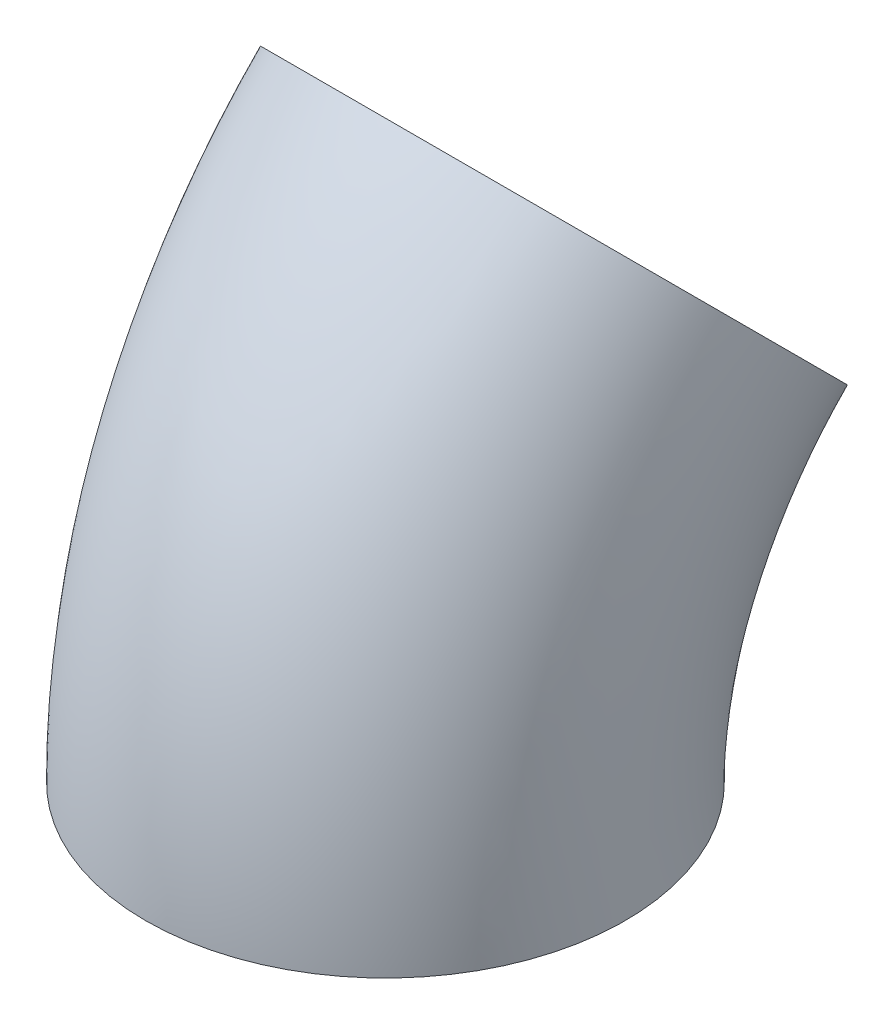
ISO-10303-21;
HEADER;
FILE_DESCRIPTION(('STEP AP214'),'2;1');
FILE_NAME('part.step','',(''),(''),'','','');
FILE_SCHEMA(('AUTOMOTIVE_DESIGN { 1 0 10303 214 1 1 1 1 }'));
ENDSEC;
DATA;
#1=APPLICATION_CONTEXT('core data for automotive mechanical design processes');
#2=APPLICATION_PROTOCOL_DEFINITION('international standard','automotive_design',2000,#1);
#3=PRODUCT_CONTEXT('',#1,'mechanical');
#4=PRODUCT('Part','Part','',(#3));
#5=PRODUCT_RELATED_PRODUCT_CATEGORY('part','',(#4));
#6=PRODUCT_DEFINITION_FORMATION('','',#4);
#7=PRODUCT_DEFINITION_CONTEXT('part definition',#1,'design');
#8=PRODUCT_DEFINITION('design','',#6,#7);
#9=PRODUCT_DEFINITION_SHAPE('','',#8);
#10=(LENGTH_UNIT() NAMED_UNIT(*) SI_UNIT(.MILLI.,.METRE.));
#11=(NAMED_UNIT(*) PLANE_ANGLE_UNIT() SI_UNIT($,.RADIAN.));
#12=(NAMED_UNIT(*) SI_UNIT($,.STERADIAN.) SOLID_ANGLE_UNIT());
#13=UNCERTAINTY_MEASURE_WITH_UNIT(LENGTH_MEASURE(1.E-05),#10,'distance_accuracy_value','');
#14=(GEOMETRIC_REPRESENTATION_CONTEXT(3) GLOBAL_UNCERTAINTY_ASSIGNED_CONTEXT((#13)) GLOBAL_UNIT_ASSIGNED_CONTEXT((#10,
#11,#12)) REPRESENTATION_CONTEXT('',''));
#15=CARTESIAN_POINT('',(0.,0.,0.));
#16=DIRECTION('',(0.,0.,1.));
#17=DIRECTION('',(1.,0.,0.));
#18=AXIS2_PLACEMENT_3D('',#15,#16,#17);
#19=CARTESIAN_POINT('',(0.,0.,-60.));
#20=DIRECTION('',(1.,0.,0.));
#21=DIRECTION('',(0.,0.,-1.));
#22=AXIS2_PLACEMENT_3D('',#19,#20,#21);
#23=TOROIDAL_SURFACE('',#22,60.,25.);
#24=CARTESIAN_POINT('',(0.,42.4264068711929,-17.5735931288072));
#25=DIRECTION('',(0.,0.707106781186547,-0.707106781186548));
#26=DIRECTION('',(0.,0.707106781186548,0.707106781186547));
#27=AXIS2_PLACEMENT_3D('',#24,#25,#26);
#28=CIRCLE('',#27,25.);
#29=CARTESIAN_POINT('',(0.,60.1040764008566,0.104076400856468));
#30=VERTEX_POINT('',#29);
#31=EDGE_CURVE('E36',#30,#30,#28,.T.);
#32=CARTESIAN_POINT('',(0.,0.,0.));
#33=DIRECTION('',(0.,1.,0.));
#34=DIRECTION('',(0.,0.,1.));
#35=AXIS2_PLACEMENT_3D('',#32,#33,#34);
#36=CIRCLE('',#35,25.);
#37=CARTESIAN_POINT('',(0.,0.,25.));
#38=VERTEX_POINT('',#37);
#39=EDGE_CURVE('E45',#38,#38,#36,.T.);
#40=CARTESIAN_POINT('',(0.,0.,-60.));
#41=DIRECTION('',(1.,0.,0.));
#42=DIRECTION('',(0.,0.,-1.));
#43=AXIS2_PLACEMENT_3D('',#40,#41,#42);
#44=CIRCLE('',#43,85.);
#45=EDGE_CURVE('',#30,#38,#44,.T.);
#46=ORIENTED_EDGE('',*,*,#31,.F.);
#47=ORIENTED_EDGE('',*,*,#39,.T.);
#48=ORIENTED_EDGE('',*,*,#45,.T.);
#49=ORIENTED_EDGE('',*,*,#45,.F.);
#50=EDGE_LOOP('',(#46,#48,#47,#49));
#51=FACE_BOUND('',#50,.T.);
#52=ADVANCED_FACE('F33',(#51),#23,.T.);
#53=CARTESIAN_POINT('',(0.,42.4264068711929,-17.5735931288072));
#54=DIRECTION('',(0.,0.707106781186547,-0.707106781186548));
#55=DIRECTION('',(0.,0.707106781186548,0.707106781186547));
#56=AXIS2_PLACEMENT_3D('',#53,#54,#55);
#57=PLANE('',#56);
#58=CARTESIAN_POINT('',(0.,42.4264068711929,-17.5735931288072));
#59=DIRECTION('',(0.,0.707106781186547,-0.707106781186548));
#60=DIRECTION('',(0.,0.707106781186548,0.707106781186547));
#61=AXIS2_PLACEMENT_3D('',#58,#59,#60);
#62=CIRCLE('',#61,20.);
#63=CARTESIAN_POINT('',(0.,56.5685424949239,-3.43145750507626));
#64=VERTEX_POINT('',#63);
#65=EDGE_CURVE('E40',#64,#64,#62,.F.);
#66=ORIENTED_EDGE('',*,*,#65,.T.);
#67=EDGE_LOOP('',(#66));
#68=FACE_BOUND('',#67,.T.);
#69=ORIENTED_EDGE('',*,*,#31,.T.);
#70=EDGE_LOOP('',(#69));
#71=FACE_BOUND('',#70,.T.);
#72=ADVANCED_FACE('F53',(#68,#71),#57,.T.);
#73=CARTESIAN_POINT('',(0.,0.,0.));
#74=DIRECTION('',(0.,1.,0.));
#75=DIRECTION('',(0.,0.,1.));
#76=AXIS2_PLACEMENT_3D('',#73,#74,#75);
#77=PLANE('',#76);
#78=CARTESIAN_POINT('',(0.,0.,0.));
#79=DIRECTION('',(0.,1.,0.));
#80=DIRECTION('',(0.,0.,1.));
#81=AXIS2_PLACEMENT_3D('',#78,#79,#80);
#82=CIRCLE('',#81,20.);
#83=CARTESIAN_POINT('',(0.,0.,20.));
#84=VERTEX_POINT('',#83);
#85=EDGE_CURVE('E10',#84,#84,#82,.F.);
#86=ORIENTED_EDGE('',*,*,#85,.F.);
#87=EDGE_LOOP('',(#86));
#88=FACE_BOUND('',#87,.T.);
#89=ORIENTED_EDGE('',*,*,#39,.F.);
#90=EDGE_LOOP('',(#89));
#91=FACE_BOUND('',#90,.T.);
#92=ADVANCED_FACE('F59',(#88,#91),#77,.F.);
#93=CARTESIAN_POINT('',(0.,0.,-60.));
#94=DIRECTION('',(1.,0.,0.));
#95=DIRECTION('',(0.,0.,-1.));
#96=AXIS2_PLACEMENT_3D('',#93,#94,#95);
#97=TOROIDAL_SURFACE('',#96,60.,20.);
#98=CARTESIAN_POINT('',(0.,0.,-60.));
#99=DIRECTION('',(1.,0.,0.));
#100=DIRECTION('',(0.,0.,-1.));
#101=AXIS2_PLACEMENT_3D('',#98,#99,#100);
#102=CIRCLE('',#101,80.);
#103=EDGE_CURVE('',#64,#84,#102,.T.);
#104=ORIENTED_EDGE('',*,*,#65,.F.);
#105=ORIENTED_EDGE('',*,*,#85,.T.);
#106=ORIENTED_EDGE('',*,*,#103,.T.);
#107=ORIENTED_EDGE('',*,*,#103,.F.);
#108=EDGE_LOOP('',(#104,#106,#105,#107));
#109=FACE_BOUND('',#108,.T.);
#110=ADVANCED_FACE('F61',(#109),#97,.F.);
#111=CLOSED_SHELL('',(#52,#72,#92,#110));
#112=MANIFOLD_SOLID_BREP('B2',#111);
#113=ADVANCED_BREP_SHAPE_REPRESENTATION('',(#18,#112),#14);
#114=SHAPE_DEFINITION_REPRESENTATION(#9,#113);
ENDSEC;
END-ISO-10303-21;
